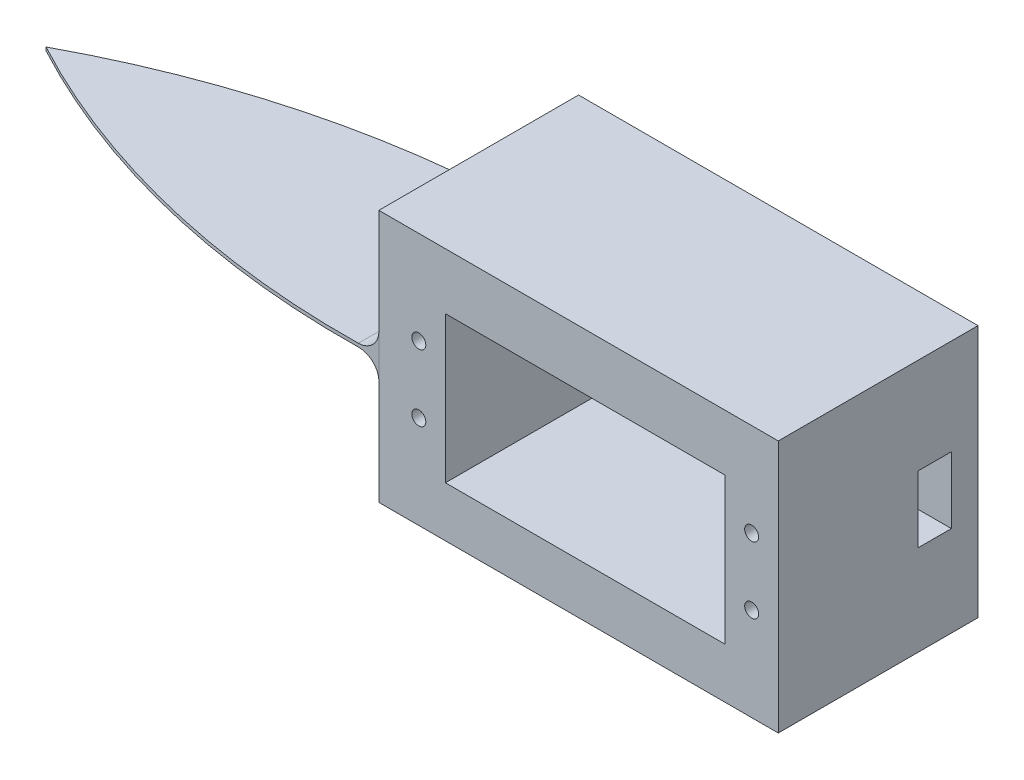
ISO-10303-21;
HEADER;
FILE_DESCRIPTION(('STEP AP214'),'2;1');
FILE_NAME('part.step','',(''),(''),'','','');
FILE_SCHEMA(('AUTOMOTIVE_DESIGN { 1 0 10303 214 1 1 1 1 }'));
ENDSEC;
DATA;
#1=APPLICATION_CONTEXT('core data for automotive mechanical design processes');
#2=APPLICATION_PROTOCOL_DEFINITION('international standard','automotive_design',2000,#1);
#3=PRODUCT_CONTEXT('',#1,'mechanical');
#4=PRODUCT('Part','Part','',(#3));
#5=PRODUCT_RELATED_PRODUCT_CATEGORY('part','',(#4));
#6=PRODUCT_DEFINITION_FORMATION('','',#4);
#7=PRODUCT_DEFINITION_CONTEXT('part definition',#1,'design');
#8=PRODUCT_DEFINITION('design','',#6,#7);
#9=PRODUCT_DEFINITION_SHAPE('','',#8);
#10=(LENGTH_UNIT() NAMED_UNIT(*) SI_UNIT(.MILLI.,.METRE.));
#11=(NAMED_UNIT(*) PLANE_ANGLE_UNIT() SI_UNIT($,.RADIAN.));
#12=(NAMED_UNIT(*) SI_UNIT($,.STERADIAN.) SOLID_ANGLE_UNIT());
#13=UNCERTAINTY_MEASURE_WITH_UNIT(LENGTH_MEASURE(1.E-05),#10,'distance_accuracy_value','');
#14=(GEOMETRIC_REPRESENTATION_CONTEXT(3) GLOBAL_UNCERTAINTY_ASSIGNED_CONTEXT((#13)) GLOBAL_UNIT_ASSIGNED_CONTEXT((#10,
#11,#12)) REPRESENTATION_CONTEXT('',''));
#15=CARTESIAN_POINT('',(0.,0.,0.));
#16=DIRECTION('',(0.,0.,1.));
#17=DIRECTION('',(1.,0.,0.));
#18=AXIS2_PLACEMENT_3D('',#15,#16,#17);
#19=CARTESIAN_POINT('',(20.7330474614907,6.88962887020134,-141.90367985973));
#20=DIRECTION('',(0.,0.,1.));
#21=DIRECTION('',(1.,0.,0.));
#22=AXIS2_PLACEMENT_3D('',#19,#20,#21);
#23=CYLINDRICAL_SURFACE('',#22,3.);
#24=DIRECTION('',(0.,0.,-1.));
#25=VECTOR('',#24,1.);
#26=CARTESIAN_POINT('',(20.7330474614907,3.88962887020134,-141.90367985973));
#27=LINE('',#26,#25);
#28=CARTESIAN_POINT('',(20.7330474614907,3.88962887020134,-14.9185791989542));
#29=VERTEX_POINT('',#28);
#30=CARTESIAN_POINT('',(20.7330474614909,3.88962887020134,-45.0814208010458));
#31=VERTEX_POINT('',#30);
#32=EDGE_CURVE('E169',#29,#31,#27,.T.);
#33=ORIENTED_EDGE('',*,*,#32,.F.);
#34=CARTESIAN_POINT('',(20.7330474614907,3.88962887020134,-14.9185791989542));
#35=CARTESIAN_POINT('',(20.8174437341798,3.8896207779731,-14.9198712607163));
#36=CARTESIAN_POINT('',(20.9018347910847,3.8931902039547,-14.9212490177742));
#37=CARTESIAN_POINT('',(21.0700100311668,3.90742077981252,-14.9241607449337));
#38=CARTESIAN_POINT('',(21.1537942446803,3.91808157268298,-14.9256947071682));
#39=CARTESIAN_POINT('',(21.3201001671258,3.94642002774165,-14.928902492407));
#40=CARTESIAN_POINT('',(21.402622849451,3.96409196345389,-14.9305762003928));
#41=CARTESIAN_POINT('',(21.5658636789148,4.00630879266722,-14.934042844555));
#42=CARTESIAN_POINT('',(21.6465818469567,4.03085360650939,-14.9358357793492));
#43=CARTESIAN_POINT('',(21.8852485180345,4.11459725947075,-14.9413599721025));
#44=CARTESIAN_POINT('',(22.0397798218832,4.18391741138222,-14.9452380002797));
#45=CARTESIAN_POINT('',(22.3349051623311,4.34747372945078,-14.9531402154769));
#46=CARTESIAN_POINT('',(22.4755007330017,4.4417071489114,-14.9571643863425));
#47=CARTESIAN_POINT('',(22.738943304813,4.65248080480235,-14.9650907790818));
#48=CARTESIAN_POINT('',(22.8617848246294,4.76902790457344,-14.9689929630035));
#49=CARTESIAN_POINT('',(23.0861512689847,5.02110716019958,-14.9763923034184));
#50=CARTESIAN_POINT('',(23.1876762375941,5.15663927680339,-14.9798894607489));
#51=CARTESIAN_POINT('',(23.3665112737786,5.44278925325287,-14.9862149189393));
#52=CARTESIAN_POINT('',(23.4438258897271,5.59340427246383,-14.9890433454084));
#53=CARTESIAN_POINT('',(23.5720841156532,5.90560073144451,-14.9938132460576));
#54=CARTESIAN_POINT('',(23.6230248134394,6.06718338002574,-14.9957546222874));
#55=CARTESIAN_POINT('',(23.6785129068275,6.31398151287236,-14.9978853675839));
#56=CARTESIAN_POINT('',(23.6935212551188,6.39697510902526,-14.9984653743577));
#57=CARTESIAN_POINT('',(23.716506783224,6.56395560635813,-14.9993559593844));
#58=CARTESIAN_POINT('',(23.7244838818621,6.6479425189946,-14.9996665345267));
#59=CARTESIAN_POINT('',(23.7333386232541,6.81635397515543,-15.0000112329252));
#60=CARTESIAN_POINT('',(23.734210422861,6.90077882174818,-15.0000451286499));
#61=CARTESIAN_POINT('',(23.7288459658642,7.06940607653108,-14.9998364810179));
#62=CARTESIAN_POINT('',(23.722609355818,7.15360847345197,-14.9995939239154));
#63=CARTESIAN_POINT('',(23.7128218606122,7.23739967164997,-14.999213443524));
#64=B_SPLINE_CURVE_WITH_KNOTS('',3,(#34,#35,#36,#37,#38,#39,#40,#41,#42,#43,#44,#45,#46,#47,#48,
#49,#50,#51,#52,#53,#54,#55,#56,#57,#58,#59,#60,#61,#62,#63),.UNSPECIFIED.,.F.,.F.,(4,2,2,2,2,2,
2,2,2,2,2,2,2,2,4),(0.,0.253135983667156,0.506259224492428,0.759176146619521,1.01209013747768,
1.51770579847131,2.02326573839101,2.52898143123072,3.0346960785262,3.54031566066427,
4.04599106109518,4.29877057181997,4.55155300084863,4.8045432882728,5.05754615536812),.UNSPECIFIED.);
#65=CARTESIAN_POINT('',(23.7330474614907,6.88962887020134,-15.));
#66=VERTEX_POINT('',#65);
#67=EDGE_CURVE('E53',#29,#66,#64,.T.);
#68=ORIENTED_EDGE('',*,*,#67,.T.);
#69=DIRECTION('',(0.,0.,-1.));
#70=VECTOR('',#69,1.);
#71=CARTESIAN_POINT('',(23.7330474614907,6.88962887020134,-141.90367985973));
#72=LINE('',#71,#70);
#73=CARTESIAN_POINT('',(23.7330474614908,6.88962887020134,-45.));
#74=VERTEX_POINT('',#73);
#75=EDGE_CURVE('E479',#74,#66,#72,.F.);
#76=ORIENTED_EDGE('',*,*,#75,.F.);
#77=CARTESIAN_POINT('',(20.7330474614909,3.88962887020134,-45.0814208010458));
#78=CARTESIAN_POINT('',(20.81744373418,3.8896207779731,-45.0801287392837));
#79=CARTESIAN_POINT('',(20.9018347910848,3.89319020395471,-45.0787509822259));
#80=CARTESIAN_POINT('',(21.070010031167,3.90742077981254,-45.0758392550662));
#81=CARTESIAN_POINT('',(21.1537942446804,3.918081572683,-45.0743052928317));
#82=CARTESIAN_POINT('',(21.320100167126,3.94642002774168,-45.0710975075929));
#83=CARTESIAN_POINT('',(21.4026228494511,3.96409196345393,-45.0694237996072));
#84=CARTESIAN_POINT('',(21.565863678915,4.00630879266728,-45.065957155445));
#85=CARTESIAN_POINT('',(21.6465818469568,4.03085360650945,-45.0641642206508));
#86=CARTESIAN_POINT('',(21.8852485180346,4.11459725947082,-45.0586400278975));
#87=CARTESIAN_POINT('',(22.0397798218833,4.1839174113823,-45.0547619997203));
#88=CARTESIAN_POINT('',(22.3349051623312,4.34747372945087,-45.0468597845231));
#89=CARTESIAN_POINT('',(22.4755007330019,4.44170714891151,-45.0428356136575));
#90=CARTESIAN_POINT('',(22.7389433048131,4.65248080480248,-45.0349092209182));
#91=CARTESIAN_POINT('',(22.8617848246296,4.76902790457358,-45.0310070369964));
#92=CARTESIAN_POINT('',(23.0861512689848,5.02110716019973,-45.0236076965816));
#93=CARTESIAN_POINT('',(23.1876762375942,5.15663927680354,-45.0201105392511));
#94=CARTESIAN_POINT('',(23.3665112737787,5.44278925325303,-45.0137850810607));
#95=CARTESIAN_POINT('',(23.4438258897272,5.59340427246399,-45.0109566545916));
#96=CARTESIAN_POINT('',(23.5720841156532,5.90560073144468,-45.0061867539424));
#97=CARTESIAN_POINT('',(23.6230248134395,6.06718338002591,-45.0042453777126));
#98=CARTESIAN_POINT('',(23.6785129068275,6.31398151287254,-45.0021146324161));
#99=CARTESIAN_POINT('',(23.6935212551188,6.39697510902544,-45.0015346256423));
#100=CARTESIAN_POINT('',(23.716506783224,6.56395560635831,-45.0006440406155));
#101=CARTESIAN_POINT('',(23.7244838818621,6.64794251899478,-45.0003334654732));
#102=CARTESIAN_POINT('',(23.7333386232542,6.81635397515561,-44.9999887670748));
#103=CARTESIAN_POINT('',(23.734210422861,6.90077882174836,-44.99995487135));
#104=CARTESIAN_POINT('',(23.7288459658642,7.06940607653126,-45.000163518982));
#105=CARTESIAN_POINT('',(23.722609355818,7.15360847345216,-45.0004060760845));
#106=CARTESIAN_POINT('',(23.7128218606122,7.23739967165015,-45.0007865564761));
#107=B_SPLINE_CURVE_WITH_KNOTS('',3,(#77,#78,#79,#80,#81,#82,#83,#84,#85,#86,#87,#88,#89,#90,
#91,#92,#93,#94,#95,#96,#97,#98,#99,#100,#101,#102,#103,#104,#105,#106),.UNSPECIFIED.,.F.,.F.,
(4,2,2,2,2,2,2,2,2,2,2,2,2,2,4),(0.,0.253135983667156,0.506259224492425,0.75917614661952,
1.01209013747768,1.51770579847131,2.02326573839102,2.52898143123073,3.0346960785262,
3.54031566066427,4.04599106109518,4.29877057181997,4.55155300084863,4.8045432882728,
5.05754615536812),.UNSPECIFIED.);
#108=EDGE_CURVE('E11',#74,#31,#107,.F.);
#109=ORIENTED_EDGE('',*,*,#108,.T.);
#110=EDGE_LOOP('',(#33,#68,#76,#109));
#111=FACE_BOUND('',#110,.T.);
#112=ADVANCED_FACE('F39',(#111),#23,.F.);
#113=CARTESIAN_POINT('',(20.7330474614907,0.389628870201336,-141.90367985973));
#114=DIRECTION('',(0.,0.,1.));
#115=DIRECTION('',(1.,0.,0.));
#116=AXIS2_PLACEMENT_3D('',#113,#114,#115);
#117=CYLINDRICAL_SURFACE('',#116,3.);
#118=DIRECTION('',(0.,0.,1.));
#119=VECTOR('',#118,1.);
#120=CARTESIAN_POINT('',(20.7330474614907,3.38962887020134,-141.90367985973));
#121=LINE('',#120,#119);
#122=CARTESIAN_POINT('',(20.7330474614907,3.38962887020134,-45.0814208010459));
#123=VERTEX_POINT('',#122);
#124=CARTESIAN_POINT('',(20.7330474614907,3.38962887020134,-14.9185791989542));
#125=VERTEX_POINT('',#124);
#126=EDGE_CURVE('E353',#123,#125,#121,.T.);
#127=ORIENTED_EDGE('',*,*,#126,.F.);
#128=CARTESIAN_POINT('',(20.7330474614907,3.38962887020134,-45.0814208010459));
#129=CARTESIAN_POINT('',(20.8174437341798,3.38963696242958,-45.0801287392837));
#130=CARTESIAN_POINT('',(20.9018347910846,3.38606753644798,-45.0787509822258));
#131=CARTESIAN_POINT('',(21.0700100311668,3.37183696059016,-45.0758392550663));
#132=CARTESIAN_POINT('',(21.1537942446802,3.3611761677197,-45.0743052928318));
#133=CARTESIAN_POINT('',(21.3201001671257,3.33283771266103,-45.071097507593));
#134=CARTESIAN_POINT('',(21.4026228494509,3.31516577694879,-45.0694237996072));
#135=CARTESIAN_POINT('',(21.5658636789148,3.27294894773546,-45.065957155445));
#136=CARTESIAN_POINT('',(21.6465818469566,3.24840413389329,-45.0641642206507));
#137=CARTESIAN_POINT('',(21.8852485180344,3.16466048093194,-45.0586400278975));
#138=CARTESIAN_POINT('',(22.0397798218831,3.09534032902047,-45.0547619997203));
#139=CARTESIAN_POINT('',(22.334905162331,2.93178401095192,-45.0468597845231));
#140=CARTESIAN_POINT('',(22.4755007330017,2.83755059149129,-45.0428356136575));
#141=CARTESIAN_POINT('',(22.7389433048129,2.62677693560035,-45.0349092209182));
#142=CARTESIAN_POINT('',(22.8617848246294,2.51022983582926,-45.0310070369965));
#143=CARTESIAN_POINT('',(23.0861512689847,2.25815058020312,-45.0236076965816));
#144=CARTESIAN_POINT('',(23.1876762375941,2.12261846359932,-45.0201105392511));
#145=CARTESIAN_POINT('',(23.3665112737786,1.83646848714984,-45.0137850810608));
#146=CARTESIAN_POINT('',(23.4438258897271,1.68585346793888,-45.0109566545916));
#147=CARTESIAN_POINT('',(23.5720841156531,1.37365700895821,-45.0061867539424));
#148=CARTESIAN_POINT('',(23.6230248134394,1.21207436037698,-45.0042453777126));
#149=CARTESIAN_POINT('',(23.6785129068275,0.965276227530356,-45.0021146324161));
#150=CARTESIAN_POINT('',(23.6935212551188,0.882282631377452,-45.0015346256423));
#151=CARTESIAN_POINT('',(23.716506783224,0.715302134044585,-45.0006440406156));
#152=CARTESIAN_POINT('',(23.7244838818621,0.631315221408116,-45.0003334654732));
#153=CARTESIAN_POINT('',(23.7333386232541,0.462903765247286,-44.9999887670748));
#154=CARTESIAN_POINT('',(23.734210422861,0.378478918654535,-44.9999548713501));
#155=CARTESIAN_POINT('',(23.7288459658642,0.209851663871638,-45.0001635189821));
#156=CARTESIAN_POINT('',(23.722609355818,0.125649266950742,-45.0004060760846));
#157=CARTESIAN_POINT('',(23.7128218606122,0.0418580687527476,-45.000786556476));
#158=B_SPLINE_CURVE_WITH_KNOTS('',3,(#128,#129,#130,#131,#132,#133,#134,#135,#136,#137,#138,
#139,#140,#141,#142,#143,#144,#145,#146,#147,#148,#149,#150,#151,#152,#153,#154,#155,#156,#157),
.UNSPECIFIED.,.F.,.F.,(4,2,2,2,2,2,2,2,2,2,2,2,2,2,4),(0.,0.253135983667159,0.506259224492432,
0.759176146619528,1.01209013747768,1.51770579847132,2.02326573839102,2.52898143123073,
3.03469607852621,3.54031566066428,4.04599106109518,4.29877057181998,4.55155300084864,
4.80454328827281,5.05754615536813),.UNSPECIFIED.);
#159=CARTESIAN_POINT('',(23.7330474614907,0.389628870201338,-45.));
#160=VERTEX_POINT('',#159);
#161=EDGE_CURVE('E361',#123,#160,#158,.T.);
#162=ORIENTED_EDGE('',*,*,#161,.T.);
#163=DIRECTION('',(0.,0.,1.));
#164=VECTOR('',#163,1.);
#165=CARTESIAN_POINT('',(23.7330474614907,0.389628870201337,0.));
#166=LINE('',#165,#164);
#167=CARTESIAN_POINT('',(23.7330474614907,0.389628870201338,-15.));
#168=VERTEX_POINT('',#167);
#169=EDGE_CURVE('E357',#168,#160,#166,.F.);
#170=ORIENTED_EDGE('',*,*,#169,.F.);
#171=CARTESIAN_POINT('',(20.7330474614907,3.38962887020134,-14.9185791989542));
#172=CARTESIAN_POINT('',(20.8174437341798,3.38963696242958,-14.9198712607163));
#173=CARTESIAN_POINT('',(20.9018347910847,3.38606753644798,-14.9212490177742));
#174=CARTESIAN_POINT('',(21.0700100311668,3.37183696059015,-14.9241607449337));
#175=CARTESIAN_POINT('',(21.1537942446803,3.3611761677197,-14.9256947071682));
#176=CARTESIAN_POINT('',(21.3201001671258,3.33283771266103,-14.928902492407));
#177=CARTESIAN_POINT('',(21.402622849451,3.31516577694878,-14.9305762003928));
#178=CARTESIAN_POINT('',(21.5658636789148,3.27294894773545,-14.934042844555));
#179=CARTESIAN_POINT('',(21.6465818469567,3.24840413389328,-14.9358357793492));
#180=CARTESIAN_POINT('',(21.8852485180345,3.16466048093192,-14.9413599721025));
#181=CARTESIAN_POINT('',(22.0397798218832,3.09534032902045,-14.9452380002797));
#182=CARTESIAN_POINT('',(22.3349051623311,2.9317840109519,-14.9531402154769));
#183=CARTESIAN_POINT('',(22.4755007330017,2.83755059149127,-14.9571643863425));
#184=CARTESIAN_POINT('',(22.738943304813,2.62677693560032,-14.9650907790818));
#185=CARTESIAN_POINT('',(22.8617848246294,2.51022983582923,-14.9689929630035));
#186=CARTESIAN_POINT('',(23.0861512689847,2.25815058020309,-14.9763923034184));
#187=CARTESIAN_POINT('',(23.1876762375941,2.12261846359928,-14.9798894607489));
#188=CARTESIAN_POINT('',(23.3665112737786,1.8364684871498,-14.9862149189393));
#189=CARTESIAN_POINT('',(23.4438258897271,1.68585346793884,-14.9890433454084));
#190=CARTESIAN_POINT('',(23.5720841156532,1.37365700895816,-14.9938132460576));
#191=CARTESIAN_POINT('',(23.6230248134394,1.21207436037693,-14.9957546222874));
#192=CARTESIAN_POINT('',(23.6785129068275,0.965276227530312,-14.9978853675839));
#193=CARTESIAN_POINT('',(23.6935212551188,0.882282631377409,-14.9984653743577));
#194=CARTESIAN_POINT('',(23.716506783224,0.715302134044542,-14.9993559593844));
#195=CARTESIAN_POINT('',(23.7244838818621,0.631315221408073,-14.9996665345267));
#196=CARTESIAN_POINT('',(23.7333386232542,0.462903765247244,-15.0000112329252));
#197=CARTESIAN_POINT('',(23.734210422861,0.378478918654492,-15.0000451286499));
#198=CARTESIAN_POINT('',(23.7288459658642,0.209851663871596,-14.9998364810179));
#199=CARTESIAN_POINT('',(23.722609355818,0.125649266950701,-14.9995939239154));
#200=CARTESIAN_POINT('',(23.7128218606122,0.0418580687527065,-14.999213443524));
#201=B_SPLINE_CURVE_WITH_KNOTS('',3,(#171,#172,#173,#174,#175,#176,#177,#178,#179,#180,#181,
#182,#183,#184,#185,#186,#187,#188,#189,#190,#191,#192,#193,#194,#195,#196,#197,#198,#199,#200),
.UNSPECIFIED.,.F.,.F.,(4,2,2,2,2,2,2,2,2,2,2,2,2,2,4),(0.,0.253135983667156,0.506259224492428,
0.759176146619529,1.01209013747768,1.51770579847131,2.02326573839102,2.52898143123072,
3.0346960785262,3.54031566066428,4.04599106109518,4.29877057181997,4.55155300084864,
4.80454328827281,5.05754615536812),.UNSPECIFIED.);
#202=EDGE_CURVE('E369',#168,#125,#201,.F.);
#203=ORIENTED_EDGE('',*,*,#202,.T.);
#204=EDGE_LOOP('',(#127,#162,#170,#203));
#205=FACE_BOUND('',#204,.T.);
#206=ADVANCED_FACE('F378',(#205),#117,.F.);
#207=CARTESIAN_POINT('',(23.7330474614907,0.,0.));
#208=DIRECTION('',(1.,0.,0.));
#209=DIRECTION('',(0.,1.,0.));
#210=AXIS2_PLACEMENT_3D('',#207,#208,#209);
#211=PLANE('',#210);
#212=DIRECTION('',(0.,1.,0.));
#213=VECTOR('',#212,1.);
#214=CARTESIAN_POINT('',(23.7330474614907,22.6396288702013,-15.));
#215=LINE('',#214,#213);
#216=CARTESIAN_POINT('',(23.7330474614907,-15.3603711297987,-15.));
#217=VERTEX_POINT('',#216);
#218=EDGE_CURVE('E314',#217,#168,#215,.T.);
#219=ORIENTED_EDGE('',*,*,#218,.T.);
#220=ORIENTED_EDGE('',*,*,#169,.T.);
#221=DIRECTION('',(0.,1.,0.));
#222=VECTOR('',#221,1.);
#223=CARTESIAN_POINT('',(23.7330474614907,11.6396288702014,-45.));
#224=LINE('',#223,#222);
#225=CARTESIAN_POINT('',(23.7330474614907,-15.3603711297987,-45.));
#226=VERTEX_POINT('',#225);
#227=EDGE_CURVE('E341',#226,#160,#224,.T.);
#228=ORIENTED_EDGE('',*,*,#227,.F.);
#229=DIRECTION('',(0.,0.,-1.));
#230=VECTOR('',#229,1.);
#231=CARTESIAN_POINT('',(23.7330474614907,-15.3603711297987,-15.));
#232=LINE('',#231,#230);
#233=EDGE_CURVE('E327',#217,#226,#232,.T.);
#234=ORIENTED_EDGE('',*,*,#233,.F.);
#235=EDGE_LOOP('',(#219,#220,#228,#234));
#236=FACE_BOUND('',#235,.T.);
#237=ADVANCED_FACE('F382',(#236),#211,.F.);
#238=CARTESIAN_POINT('',(27.7330474614907,11.6396288702014,-45.));
#239=DIRECTION('',(0.,0.,1.));
#240=DIRECTION('',(1.,0.,0.));
#241=AXIS2_PLACEMENT_3D('',#238,#239,#240);
#242=PLANE('',#241);
#243=ORIENTED_EDGE('',*,*,#227,.T.);
#244=DIRECTION('',(0.,1.,0.));
#245=VECTOR('',#244,1.);
#246=CARTESIAN_POINT('',(23.7330474614908,3.38962887020134,-45.));
#247=LINE('',#246,#245);
#248=EDGE_CURVE('E68',#160,#74,#247,.T.);
#249=ORIENTED_EDGE('',*,*,#248,.T.);
#250=DIRECTION('',(0.,1.,0.));
#251=VECTOR('',#250,1.);
#252=CARTESIAN_POINT('',(23.7330474614908,3.88962887020134,-45.));
#253=LINE('',#252,#251);
#254=CARTESIAN_POINT('',(23.7330474614908,22.6396288702013,-45.));
#255=VERTEX_POINT('',#254);
#256=EDGE_CURVE('E490',#74,#255,#253,.T.);
#257=ORIENTED_EDGE('',*,*,#256,.T.);
#258=DIRECTION('',(1.,0.,0.));
#259=VECTOR('',#258,1.);
#260=CARTESIAN_POINT('',(23.7330474614907,22.6396288702013,-45.));
#261=LINE('',#260,#259);
#262=CARTESIAN_POINT('',(83.7330474614907,22.6396288702013,-45.));
#263=VERTEX_POINT('',#262);
#264=EDGE_CURVE('E301',#255,#263,#261,.T.);
#265=ORIENTED_EDGE('',*,*,#264,.T.);
#266=DIRECTION('',(0.,-1.,0.));
#267=VECTOR('',#266,1.);
#268=CARTESIAN_POINT('',(83.7330474614907,-15.3603711297987,-45.));
#269=LINE('',#268,#267);
#270=CARTESIAN_POINT('',(83.7330474614907,-15.3603711297987,-45.));
#271=VERTEX_POINT('',#270);
#272=EDGE_CURVE('E331',#263,#271,#269,.T.);
#273=ORIENTED_EDGE('',*,*,#272,.T.);
#274=DIRECTION('',(-1.,0.,0.));
#275=VECTOR('',#274,1.);
#276=CARTESIAN_POINT('',(30.9461924588656,-15.3603711297987,-45.));
#277=LINE('',#276,#275);
#278=EDGE_CURVE('E315',#271,#226,#277,.T.);
#279=ORIENTED_EDGE('',*,*,#278,.T.);
#280=EDGE_LOOP('',(#243,#249,#257,#265,#273,#279));
#281=FACE_BOUND('',#280,.T.);
#282=ADVANCED_FACE('F384',(#281),#242,.F.);
#283=CARTESIAN_POINT('',(0.,0.,-15.));
#284=DIRECTION('',(0.,0.,1.));
#285=DIRECTION('',(1.,0.,0.));
#286=AXIS2_PLACEMENT_3D('',#283,#284,#285);
#287=PLANE('',#286);
#288=ORIENTED_EDGE('',*,*,#218,.F.);
#289=DIRECTION('',(-1.,0.,0.));
#290=VECTOR('',#289,1.);
#291=CARTESIAN_POINT('',(23.7330474614907,-15.3603711297987,-15.));
#292=LINE('',#291,#290);
#293=CARTESIAN_POINT('',(83.7330474614907,-15.3603711297987,-15.));
#294=VERTEX_POINT('',#293);
#295=EDGE_CURVE('E310',#294,#217,#292,.T.);
#296=ORIENTED_EDGE('',*,*,#295,.F.);
#297=DIRECTION('',(0.,-1.,0.));
#298=VECTOR('',#297,1.);
#299=CARTESIAN_POINT('',(83.7330474614907,-15.3603711297987,-15.));
#300=LINE('',#299,#298);
#301=CARTESIAN_POINT('',(83.7330474614907,22.6396288702013,-15.));
#302=VERTEX_POINT('',#301);
#303=EDGE_CURVE('E323',#302,#294,#300,.T.);
#304=ORIENTED_EDGE('',*,*,#303,.F.);
#305=DIRECTION('',(1.,0.,0.));
#306=VECTOR('',#305,1.);
#307=CARTESIAN_POINT('',(23.7330474614907,22.6396288702013,-15.));
#308=LINE('',#307,#306);
#309=CARTESIAN_POINT('',(23.7330474614907,22.6396288702013,-15.));
#310=VERTEX_POINT('',#309);
#311=EDGE_CURVE('E319',#310,#302,#308,.T.);
#312=ORIENTED_EDGE('',*,*,#311,.F.);
#313=DIRECTION('',(0.,1.,0.));
#314=VECTOR('',#313,1.);
#315=CARTESIAN_POINT('',(23.7330474614907,3.88962887020133,-15.));
#316=LINE('',#315,#314);
#317=EDGE_CURVE('E173',#66,#310,#316,.T.);
#318=ORIENTED_EDGE('',*,*,#317,.F.);
#319=DIRECTION('',(0.,1.,0.));
#320=VECTOR('',#319,1.);
#321=CARTESIAN_POINT('',(23.7330474614907,3.38962887020133,-15.));
#322=LINE('',#321,#320);
#323=EDGE_CURVE('E60',#168,#66,#322,.T.);
#324=ORIENTED_EDGE('',*,*,#323,.F.);
#325=EDGE_LOOP('',(#288,#296,#304,#312,#318,#324));
#326=FACE_BOUND('',#325,.T.);
#327=CARTESIAN_POINT('',(29.7330474614907,-1.36037112979867,-15.));
#328=DIRECTION('',(0.,0.,1.));
#329=DIRECTION('',(1.,0.,0.));
#330=AXIS2_PLACEMENT_3D('',#327,#328,#329);
#331=CIRCLE('',#330,1.05);
#332=CARTESIAN_POINT('',(30.7830474614907,-1.36037112979867,-15.));
#333=VERTEX_POINT('',#332);
#334=EDGE_CURVE('E263',#333,#333,#331,.T.);
#335=ORIENTED_EDGE('',*,*,#334,.F.);
#336=EDGE_LOOP('',(#335));
#337=FACE_BOUND('',#336,.T.);
#338=CARTESIAN_POINT('',(79.7330474614908,8.63962887020133,-15.));
#339=DIRECTION('',(0.,0.,1.));
#340=DIRECTION('',(1.,0.,0.));
#341=AXIS2_PLACEMENT_3D('',#338,#339,#340);
#342=CIRCLE('',#341,1.04999999999999);
#343=CARTESIAN_POINT('',(80.7830474614907,8.63962887020133,-15.));
#344=VERTEX_POINT('',#343);
#345=EDGE_CURVE('E254',#344,#344,#342,.T.);
#346=ORIENTED_EDGE('',*,*,#345,.F.);
#347=EDGE_LOOP('',(#346));
#348=FACE_BOUND('',#347,.T.);
#349=CARTESIAN_POINT('',(79.7330474614908,-1.36037112979867,-15.));
#350=DIRECTION('',(0.,0.,1.));
#351=DIRECTION('',(1.,0.,0.));
#352=AXIS2_PLACEMENT_3D('',#349,#350,#351);
#353=CIRCLE('',#352,1.04999999999999);
#354=CARTESIAN_POINT('',(80.7830474614907,-1.36037112979867,-15.));
#355=VERTEX_POINT('',#354);
#356=EDGE_CURVE('E246',#355,#355,#353,.T.);
#357=ORIENTED_EDGE('',*,*,#356,.F.);
#358=EDGE_LOOP('',(#357));
#359=FACE_BOUND('',#358,.T.);
#360=CARTESIAN_POINT('',(29.7330474614907,8.63962887020133,-15.));
#361=DIRECTION('',(0.,0.,1.));
#362=DIRECTION('',(1.,0.,0.));
#363=AXIS2_PLACEMENT_3D('',#360,#361,#362);
#364=CIRCLE('',#363,1.05);
#365=CARTESIAN_POINT('',(30.7830474614907,8.63962887020133,-15.));
#366=VERTEX_POINT('',#365);
#367=EDGE_CURVE('E262',#366,#366,#364,.T.);
#368=ORIENTED_EDGE('',*,*,#367,.F.);
#369=EDGE_LOOP('',(#368));
#370=FACE_BOUND('',#369,.T.);
#371=DIRECTION('',(0.,-1.,0.));
#372=VECTOR('',#371,1.);
#373=CARTESIAN_POINT('',(33.7330474614907,3.1939047432246,-15.));
#374=LINE('',#373,#372);
#375=CARTESIAN_POINT('',(33.7330474614907,14.1939047432246,-15.));
#376=VERTEX_POINT('',#375);
#377=CARTESIAN_POINT('',(33.7330474614907,-7.8060952567754,-15.));
#378=VERTEX_POINT('',#377);
#379=EDGE_CURVE('E293',#376,#378,#374,.T.);
#380=ORIENTED_EDGE('',*,*,#379,.F.);
#381=DIRECTION('',(-1.,0.,0.));
#382=VECTOR('',#381,1.);
#383=CARTESIAN_POINT('',(33.7330474614907,14.1939047432246,-15.));
#384=LINE('',#383,#382);
#385=CARTESIAN_POINT('',(75.7330474614907,14.1939047432246,-15.));
#386=VERTEX_POINT('',#385);
#387=EDGE_CURVE('E289',#386,#376,#384,.T.);
#388=ORIENTED_EDGE('',*,*,#387,.F.);
#389=DIRECTION('',(0.,1.,0.));
#390=VECTOR('',#389,1.);
#391=CARTESIAN_POINT('',(75.7330474614907,-7.8060952567754,-15.));
#392=LINE('',#391,#390);
#393=CARTESIAN_POINT('',(75.7330474614907,-7.8060952567754,-15.));
#394=VERTEX_POINT('',#393);
#395=EDGE_CURVE('E285',#394,#386,#392,.T.);
#396=ORIENTED_EDGE('',*,*,#395,.F.);
#397=DIRECTION('',(1.,0.,0.));
#398=VECTOR('',#397,1.);
#399=CARTESIAN_POINT('',(33.7330474614907,-7.8060952567754,-15.));
#400=LINE('',#399,#398);
#401=EDGE_CURVE('E278',#378,#394,#400,.T.);
#402=ORIENTED_EDGE('',*,*,#401,.F.);
#403=EDGE_LOOP('',(#380,#388,#396,#402));
#404=FACE_BOUND('',#403,.T.);
#405=ADVANCED_FACE('F388',(#326,#337,#348,#359,#370,#404),#287,.T.);
#406=CARTESIAN_POINT('',(30.9461924588656,-15.3603711297987,-15.));
#407=DIRECTION('',(0.,-1.,0.));
#408=DIRECTION('',(0.,0.,-1.));
#409=AXIS2_PLACEMENT_3D('',#406,#407,#408);
#410=PLANE('',#409);
#411=ORIENTED_EDGE('',*,*,#233,.T.);
#412=ORIENTED_EDGE('',*,*,#278,.F.);
#413=DIRECTION('',(0.,0.,-1.));
#414=VECTOR('',#413,1.);
#415=CARTESIAN_POINT('',(83.7330474614907,-15.3603711297987,-15.));
#416=LINE('',#415,#414);
#417=EDGE_CURVE('E338',#294,#271,#416,.T.);
#418=ORIENTED_EDGE('',*,*,#417,.F.);
#419=ORIENTED_EDGE('',*,*,#295,.T.);
#420=EDGE_LOOP('',(#411,#412,#418,#419));
#421=FACE_BOUND('',#420,.T.);
#422=ADVANCED_FACE('F400',(#421),#410,.T.);
#423=CARTESIAN_POINT('',(83.7330474614907,-15.3603711297987,-15.));
#424=DIRECTION('',(1.,0.,0.));
#425=DIRECTION('',(0.,0.,-1.));
#426=AXIS2_PLACEMENT_3D('',#423,#424,#425);
#427=PLANE('',#426);
#428=DIRECTION('',(0.,0.,1.));
#429=VECTOR('',#428,1.);
#430=CARTESIAN_POINT('',(83.7330474614907,8.23858499545058,-42.));
#431=LINE('',#430,#429);
#432=CARTESIAN_POINT('',(83.7330474614907,8.23858499545058,-41.));
#433=VERTEX_POINT('',#432);
#434=CARTESIAN_POINT('',(83.7330474614907,8.23858499545058,-36.));
#435=VERTEX_POINT('',#434);
#436=EDGE_CURVE('E220',#433,#435,#431,.T.);
#437=ORIENTED_EDGE('',*,*,#436,.F.);
#438=DIRECTION('',(0.,-1.,0.));
#439=VECTOR('',#438,1.);
#440=CARTESIAN_POINT('',(83.7330474614907,-15.3603711297987,-41.));
#441=LINE('',#440,#439);
#442=CARTESIAN_POINT('',(83.7330474614907,-1.76141500454942,-41.));
#443=VERTEX_POINT('',#442);
#444=EDGE_CURVE('E187',#433,#443,#441,.T.);
#445=ORIENTED_EDGE('',*,*,#444,.T.);
#446=DIRECTION('',(0.,0.,-1.));
#447=VECTOR('',#446,1.);
#448=CARTESIAN_POINT('',(83.7330474614907,-1.76141500454942,-42.));
#449=LINE('',#448,#447);
#450=CARTESIAN_POINT('',(83.7330474614907,-1.76141500454942,-36.));
#451=VERTEX_POINT('',#450);
#452=EDGE_CURVE('E225',#451,#443,#449,.T.);
#453=ORIENTED_EDGE('',*,*,#452,.F.);
#454=DIRECTION('',(0.,-1.,0.));
#455=VECTOR('',#454,1.);
#456=CARTESIAN_POINT('',(83.7330474614907,-1.76141500454942,-36.));
#457=LINE('',#456,#455);
#458=EDGE_CURVE('E236',#435,#451,#457,.T.);
#459=ORIENTED_EDGE('',*,*,#458,.F.);
#460=EDGE_LOOP('',(#437,#445,#453,#459));
#461=FACE_BOUND('',#460,.T.);
#462=ORIENTED_EDGE('',*,*,#272,.F.);
#463=DIRECTION('',(0.,0.,-1.));
#464=VECTOR('',#463,1.);
#465=CARTESIAN_POINT('',(83.7330474614907,22.6396288702013,-15.));
#466=LINE('',#465,#464);
#467=EDGE_CURVE('E342',#302,#263,#466,.T.);
#468=ORIENTED_EDGE('',*,*,#467,.F.);
#469=ORIENTED_EDGE('',*,*,#303,.T.);
#470=ORIENTED_EDGE('',*,*,#417,.T.);
#471=EDGE_LOOP('',(#462,#468,#469,#470));
#472=FACE_BOUND('',#471,.T.);
#473=ADVANCED_FACE('F396',(#461,#472),#427,.T.);
#474=CARTESIAN_POINT('',(23.7330474614907,22.6396288702013,-15.));
#475=DIRECTION('',(0.,1.,0.));
#476=DIRECTION('',(-1.,0.,0.));
#477=AXIS2_PLACEMENT_3D('',#474,#475,#476);
#478=PLANE('',#477);
#479=DIRECTION('',(0.,0.,-1.));
#480=VECTOR('',#479,1.);
#481=CARTESIAN_POINT('',(23.7330474614907,22.6396288702013,-45.));
#482=LINE('',#481,#480);
#483=EDGE_CURVE('E181',#310,#255,#482,.T.);
#484=ORIENTED_EDGE('',*,*,#483,.F.);
#485=ORIENTED_EDGE('',*,*,#311,.T.);
#486=ORIENTED_EDGE('',*,*,#467,.T.);
#487=ORIENTED_EDGE('',*,*,#264,.F.);
#488=EDGE_LOOP('',(#484,#485,#486,#487));
#489=FACE_BOUND('',#488,.T.);
#490=ADVANCED_FACE('F392',(#489),#478,.T.);
#491=CARTESIAN_POINT('',(33.7330474614907,3.1939047432246,-43.));
#492=DIRECTION('',(-1.,0.,0.));
#493=DIRECTION('',(0.,0.,1.));
#494=AXIS2_PLACEMENT_3D('',#491,#492,#493);
#495=PLANE('',#494);
#496=DIRECTION('',(0.,0.,1.));
#497=VECTOR('',#496,1.);
#498=CARTESIAN_POINT('',(33.7330474614907,-7.8060952567754,-43.));
#499=LINE('',#498,#497);
#500=CARTESIAN_POINT('',(33.7330474614907,-7.8060952567754,-41.));
#501=VERTEX_POINT('',#500);
#502=EDGE_CURVE('E297',#501,#378,#499,.T.);
#503=ORIENTED_EDGE('',*,*,#502,.F.);
#504=DIRECTION('',(0.,1.,0.));
#505=VECTOR('',#504,1.);
#506=CARTESIAN_POINT('',(33.7330474614907,3.1939047432246,-41.));
#507=LINE('',#506,#505);
#508=CARTESIAN_POINT('',(33.7330474614907,14.1939047432246,-41.));
#509=VERTEX_POINT('',#508);
#510=EDGE_CURVE('E208',#501,#509,#507,.T.);
#511=ORIENTED_EDGE('',*,*,#510,.T.);
#512=DIRECTION('',(0.,0.,1.));
#513=VECTOR('',#512,1.);
#514=CARTESIAN_POINT('',(33.7330474614907,14.1939047432246,-43.));
#515=LINE('',#514,#513);
#516=EDGE_CURVE('E298',#509,#376,#515,.T.);
#517=ORIENTED_EDGE('',*,*,#516,.T.);
#518=ORIENTED_EDGE('',*,*,#379,.T.);
#519=EDGE_LOOP('',(#503,#511,#517,#518));
#520=FACE_BOUND('',#519,.T.);
#521=ADVANCED_FACE('F395',(#520),#495,.F.);
#522=CARTESIAN_POINT('',(33.7330474614907,14.1939047432246,-43.));
#523=DIRECTION('',(0.,1.,0.));
#524=DIRECTION('',(0.,0.,1.));
#525=AXIS2_PLACEMENT_3D('',#522,#523,#524);
#526=PLANE('',#525);
#527=ORIENTED_EDGE('',*,*,#516,.F.);
#528=DIRECTION('',(1.,0.,0.));
#529=VECTOR('',#528,1.);
#530=CARTESIAN_POINT('',(33.7330474614907,14.1939047432246,-41.));
#531=LINE('',#530,#529);
#532=CARTESIAN_POINT('',(75.7330474614907,14.1939047432246,-41.));
#533=VERTEX_POINT('',#532);
#534=EDGE_CURVE('E203',#509,#533,#531,.T.);
#535=ORIENTED_EDGE('',*,*,#534,.T.);
#536=DIRECTION('',(0.,0.,1.));
#537=VECTOR('',#536,1.);
#538=CARTESIAN_POINT('',(75.7330474614907,14.1939047432246,-43.));
#539=LINE('',#538,#537);
#540=EDGE_CURVE('E302',#533,#386,#539,.T.);
#541=ORIENTED_EDGE('',*,*,#540,.T.);
#542=ORIENTED_EDGE('',*,*,#387,.T.);
#543=EDGE_LOOP('',(#527,#535,#541,#542));
#544=FACE_BOUND('',#543,.T.);
#545=ADVANCED_FACE('F416',(#544),#526,.F.);
#546=CARTESIAN_POINT('',(75.7330474614907,-7.8060952567754,-43.));
#547=DIRECTION('',(1.,0.,0.));
#548=DIRECTION('',(0.,0.,-1.));
#549=AXIS2_PLACEMENT_3D('',#546,#547,#548);
#550=PLANE('',#549);
#551=ORIENTED_EDGE('',*,*,#540,.F.);
#552=DIRECTION('',(0.,-1.,0.));
#553=VECTOR('',#552,1.);
#554=CARTESIAN_POINT('',(75.7330474614907,-7.8060952567754,-41.));
#555=LINE('',#554,#553);
#556=CARTESIAN_POINT('',(75.7330474614907,8.23858499545058,-41.));
#557=VERTEX_POINT('',#556);
#558=EDGE_CURVE('E192',#533,#557,#555,.T.);
#559=ORIENTED_EDGE('',*,*,#558,.T.);
#560=DIRECTION('',(0.,0.,1.));
#561=VECTOR('',#560,1.);
#562=CARTESIAN_POINT('',(75.7330474614907,8.23858499545058,-42.));
#563=LINE('',#562,#561);
#564=CARTESIAN_POINT('',(75.7330474614907,8.23858499545058,-36.));
#565=VERTEX_POINT('',#564);
#566=EDGE_CURVE('E221',#557,#565,#563,.T.);
#567=ORIENTED_EDGE('',*,*,#566,.T.);
#568=DIRECTION('',(0.,-1.,0.));
#569=VECTOR('',#568,1.);
#570=CARTESIAN_POINT('',(75.7330474614907,-1.76141500454942,-36.));
#571=LINE('',#570,#569);
#572=CARTESIAN_POINT('',(75.7330474614907,-1.76141500454942,-36.));
#573=VERTEX_POINT('',#572);
#574=EDGE_CURVE('E224',#565,#573,#571,.T.);
#575=ORIENTED_EDGE('',*,*,#574,.T.);
#576=DIRECTION('',(0.,0.,-1.));
#577=VECTOR('',#576,1.);
#578=CARTESIAN_POINT('',(75.7330474614907,-1.76141500454942,-42.));
#579=LINE('',#578,#577);
#580=CARTESIAN_POINT('',(75.7330474614907,-1.76141500454942,-41.));
#581=VERTEX_POINT('',#580);
#582=EDGE_CURVE('E229',#573,#581,#579,.T.);
#583=ORIENTED_EDGE('',*,*,#582,.T.);
#584=CARTESIAN_POINT('',(75.7330474614907,-7.8060952567754,-41.));
#585=VERTEX_POINT('',#584);
#586=EDGE_CURVE('E204',#581,#585,#555,.T.);
#587=ORIENTED_EDGE('',*,*,#586,.T.);
#588=DIRECTION('',(0.,0.,1.));
#589=VECTOR('',#588,1.);
#590=CARTESIAN_POINT('',(75.7330474614907,-7.8060952567754,-43.));
#591=LINE('',#590,#589);
#592=EDGE_CURVE('E305',#585,#394,#591,.T.);
#593=ORIENTED_EDGE('',*,*,#592,.T.);
#594=ORIENTED_EDGE('',*,*,#395,.T.);
#595=EDGE_LOOP('',(#551,#559,#567,#575,#583,#587,#593,#594));
#596=FACE_BOUND('',#595,.T.);
#597=ADVANCED_FACE('F412',(#596),#550,.F.);
#598=CARTESIAN_POINT('',(33.7330474614907,-7.8060952567754,-43.));
#599=DIRECTION('',(0.,-1.,0.));
#600=DIRECTION('',(0.,0.,-1.));
#601=AXIS2_PLACEMENT_3D('',#598,#599,#600);
#602=PLANE('',#601);
#603=ORIENTED_EDGE('',*,*,#592,.F.);
#604=DIRECTION('',(-1.,0.,0.));
#605=VECTOR('',#604,1.);
#606=CARTESIAN_POINT('',(33.7330474614907,-7.8060952567754,-41.));
#607=LINE('',#606,#605);
#608=EDGE_CURVE('E212',#585,#501,#607,.T.);
#609=ORIENTED_EDGE('',*,*,#608,.T.);
#610=ORIENTED_EDGE('',*,*,#502,.T.);
#611=ORIENTED_EDGE('',*,*,#401,.T.);
#612=EDGE_LOOP('',(#603,#609,#610,#611));
#613=FACE_BOUND('',#612,.T.);
#614=ADVANCED_FACE('F408',(#613),#602,.F.);
#615=CARTESIAN_POINT('',(29.7330474614907,8.63962887020133,-35.));
#616=DIRECTION('',(0.,0.,1.));
#617=DIRECTION('',(1.,0.,0.));
#618=AXIS2_PLACEMENT_3D('',#615,#616,#617);
#619=CYLINDRICAL_SURFACE('',#618,1.05);
#620=CARTESIAN_POINT('',(29.7330474614907,8.63962887020133,-35.));
#621=DIRECTION('',(0.,0.,1.));
#622=DIRECTION('',(1.,0.,0.));
#623=AXIS2_PLACEMENT_3D('',#620,#621,#622);
#624=CIRCLE('',#623,1.05);
#625=CARTESIAN_POINT('',(30.7830474614907,8.63962887020133,-35.));
#626=VERTEX_POINT('',#625);
#627=EDGE_CURVE('E274',#626,#626,#624,.T.);
#628=ORIENTED_EDGE('',*,*,#627,.F.);
#629=EDGE_LOOP('',(#628));
#630=FACE_BOUND('',#629,.T.);
#631=ORIENTED_EDGE('',*,*,#367,.T.);
#632=EDGE_LOOP('',(#631));
#633=FACE_BOUND('',#632,.T.);
#634=ADVANCED_FACE('F411',(#630,#633),#619,.F.);
#635=CARTESIAN_POINT('',(29.7330474614907,8.63962887020133,-35.));
#636=DIRECTION('',(0.,0.,1.));
#637=DIRECTION('',(1.,0.,0.));
#638=AXIS2_PLACEMENT_3D('',#635,#636,#637);
#639=PLANE('',#638);
#640=ORIENTED_EDGE('',*,*,#627,.T.);
#641=EDGE_LOOP('',(#640));
#642=FACE_BOUND('',#641,.T.);
#643=ADVANCED_FACE('F426',(#642),#639,.T.);
#644=CARTESIAN_POINT('',(79.7330474614908,-1.36037112979867,-35.));
#645=DIRECTION('',(0.,0.,1.));
#646=DIRECTION('',(1.,0.,0.));
#647=AXIS2_PLACEMENT_3D('',#644,#645,#646);
#648=CYLINDRICAL_SURFACE('',#647,1.04999999999999);
#649=CARTESIAN_POINT('',(79.7330474614908,-1.36037112979867,-35.));
#650=DIRECTION('',(0.,0.,1.));
#651=DIRECTION('',(1.,0.,0.));
#652=AXIS2_PLACEMENT_3D('',#649,#650,#651);
#653=CIRCLE('',#652,1.04999999999999);
#654=CARTESIAN_POINT('',(80.7830474614907,-1.36037112979867,-35.));
#655=VERTEX_POINT('',#654);
#656=EDGE_CURVE('E250',#655,#655,#653,.T.);
#657=ORIENTED_EDGE('',*,*,#656,.F.);
#658=EDGE_LOOP('',(#657));
#659=FACE_BOUND('',#658,.T.);
#660=ORIENTED_EDGE('',*,*,#356,.T.);
#661=EDGE_LOOP('',(#660));
#662=FACE_BOUND('',#661,.T.);
#663=ADVANCED_FACE('F430',(#659,#662),#648,.F.);
#664=CARTESIAN_POINT('',(79.7330474614908,-1.36037112979867,-35.));
#665=DIRECTION('',(0.,0.,1.));
#666=DIRECTION('',(1.,0.,0.));
#667=AXIS2_PLACEMENT_3D('',#664,#665,#666);
#668=PLANE('',#667);
#669=ORIENTED_EDGE('',*,*,#656,.T.);
#670=EDGE_LOOP('',(#669));
#671=FACE_BOUND('',#670,.T.);
#672=ADVANCED_FACE('F436',(#671),#668,.T.);
#673=CARTESIAN_POINT('',(79.7330474614908,8.63962887020133,-35.));
#674=DIRECTION('',(0.,0.,1.));
#675=DIRECTION('',(1.,0.,0.));
#676=AXIS2_PLACEMENT_3D('',#673,#674,#675);
#677=CYLINDRICAL_SURFACE('',#676,1.04999999999999);
#678=CARTESIAN_POINT('',(79.7330474614908,8.63962887020133,-35.));
#679=DIRECTION('',(0.,0.,1.));
#680=DIRECTION('',(1.,0.,0.));
#681=AXIS2_PLACEMENT_3D('',#678,#679,#680);
#682=CIRCLE('',#681,1.04999999999999);
#683=CARTESIAN_POINT('',(80.7830474614907,8.63962887020133,-35.));
#684=VERTEX_POINT('',#683);
#685=EDGE_CURVE('E267',#684,#684,#682,.T.);
#686=ORIENTED_EDGE('',*,*,#685,.F.);
#687=EDGE_LOOP('',(#686));
#688=FACE_BOUND('',#687,.T.);
#689=ORIENTED_EDGE('',*,*,#345,.T.);
#690=EDGE_LOOP('',(#689));
#691=FACE_BOUND('',#690,.T.);
#692=ADVANCED_FACE('F432',(#688,#691),#677,.F.);
#693=CARTESIAN_POINT('',(79.7330474614908,8.63962887020133,-35.));
#694=DIRECTION('',(0.,0.,1.));
#695=DIRECTION('',(1.,0.,0.));
#696=AXIS2_PLACEMENT_3D('',#693,#694,#695);
#697=PLANE('',#696);
#698=ORIENTED_EDGE('',*,*,#685,.T.);
#699=EDGE_LOOP('',(#698));
#700=FACE_BOUND('',#699,.T.);
#701=ADVANCED_FACE('F435',(#700),#697,.T.);
#702=CARTESIAN_POINT('',(29.7330474614907,-1.36037112979867,-35.));
#703=DIRECTION('',(0.,0.,1.));
#704=DIRECTION('',(1.,0.,0.));
#705=AXIS2_PLACEMENT_3D('',#702,#703,#704);
#706=CYLINDRICAL_SURFACE('',#705,1.05);
#707=CARTESIAN_POINT('',(29.7330474614907,-1.36037112979867,-35.));
#708=DIRECTION('',(0.,0.,1.));
#709=DIRECTION('',(1.,0.,0.));
#710=AXIS2_PLACEMENT_3D('',#707,#708,#709);
#711=CIRCLE('',#710,1.05);
#712=CARTESIAN_POINT('',(30.7830474614907,-1.36037112979867,-35.));
#713=VERTEX_POINT('',#712);
#714=EDGE_CURVE('E258',#713,#713,#711,.T.);
#715=ORIENTED_EDGE('',*,*,#714,.F.);
#716=EDGE_LOOP('',(#715));
#717=FACE_BOUND('',#716,.T.);
#718=ORIENTED_EDGE('',*,*,#334,.T.);
#719=EDGE_LOOP('',(#718));
#720=FACE_BOUND('',#719,.T.);
#721=ADVANCED_FACE('F440',(#717,#720),#706,.F.);
#722=CARTESIAN_POINT('',(29.7330474614907,-1.36037112979867,-35.));
#723=DIRECTION('',(0.,0.,1.));
#724=DIRECTION('',(1.,0.,0.));
#725=AXIS2_PLACEMENT_3D('',#722,#723,#724);
#726=PLANE('',#725);
#727=ORIENTED_EDGE('',*,*,#714,.T.);
#728=EDGE_LOOP('',(#727));
#729=FACE_BOUND('',#728,.T.);
#730=ADVANCED_FACE('F444',(#729),#726,.T.);
#731=CARTESIAN_POINT('',(75.7330474614907,-1.76141500454942,-42.));
#732=DIRECTION('',(0.,-1.,0.));
#733=DIRECTION('',(0.,0.,-1.));
#734=AXIS2_PLACEMENT_3D('',#731,#732,#733);
#735=PLANE('',#734);
#736=ORIENTED_EDGE('',*,*,#452,.T.);
#737=DIRECTION('',(-1.,0.,0.));
#738=VECTOR('',#737,1.);
#739=CARTESIAN_POINT('',(75.7330474614907,-1.76141500454942,-41.));
#740=LINE('',#739,#738);
#741=EDGE_CURVE('E216',#443,#581,#740,.T.);
#742=ORIENTED_EDGE('',*,*,#741,.T.);
#743=ORIENTED_EDGE('',*,*,#582,.F.);
#744=DIRECTION('',(1.,0.,0.));
#745=VECTOR('',#744,1.);
#746=CARTESIAN_POINT('',(75.7330474614907,-1.76141500454942,-36.));
#747=LINE('',#746,#745);
#748=EDGE_CURVE('E243',#573,#451,#747,.T.);
#749=ORIENTED_EDGE('',*,*,#748,.T.);
#750=EDGE_LOOP('',(#736,#742,#743,#749));
#751=FACE_BOUND('',#750,.T.);
#752=ADVANCED_FACE('F448',(#751),#735,.F.);
#753=CARTESIAN_POINT('',(75.7330474614907,-1.76141500454942,-36.));
#754=DIRECTION('',(0.,0.,1.));
#755=DIRECTION('',(1.,0.,0.));
#756=AXIS2_PLACEMENT_3D('',#753,#754,#755);
#757=PLANE('',#756);
#758=ORIENTED_EDGE('',*,*,#458,.T.);
#759=ORIENTED_EDGE('',*,*,#748,.F.);
#760=ORIENTED_EDGE('',*,*,#574,.F.);
#761=DIRECTION('',(1.,0.,0.));
#762=VECTOR('',#761,1.);
#763=CARTESIAN_POINT('',(75.7330474614907,8.23858499545058,-36.));
#764=LINE('',#763,#762);
#765=EDGE_CURVE('E233',#565,#435,#764,.T.);
#766=ORIENTED_EDGE('',*,*,#765,.T.);
#767=EDGE_LOOP('',(#758,#759,#760,#766));
#768=FACE_BOUND('',#767,.T.);
#769=ADVANCED_FACE('F460',(#768),#757,.F.);
#770=CARTESIAN_POINT('',(75.7330474614907,8.23858499545058,-42.));
#771=DIRECTION('',(0.,1.,0.));
#772=DIRECTION('',(0.,0.,1.));
#773=AXIS2_PLACEMENT_3D('',#770,#771,#772);
#774=PLANE('',#773);
#775=ORIENTED_EDGE('',*,*,#566,.F.);
#776=DIRECTION('',(1.,0.,0.));
#777=VECTOR('',#776,1.);
#778=CARTESIAN_POINT('',(75.7330474614907,8.23858499545058,-41.));
#779=LINE('',#778,#777);
#780=EDGE_CURVE('E349',#557,#433,#779,.T.);
#781=ORIENTED_EDGE('',*,*,#780,.T.);
#782=ORIENTED_EDGE('',*,*,#436,.T.);
#783=ORIENTED_EDGE('',*,*,#765,.F.);
#784=EDGE_LOOP('',(#775,#781,#782,#783));
#785=FACE_BOUND('',#784,.T.);
#786=ADVANCED_FACE('F456',(#785),#774,.F.);
#787=CARTESIAN_POINT('',(0.,0.,-41.));
#788=DIRECTION('',(0.,0.,1.));
#789=DIRECTION('',(1.,0.,0.));
#790=AXIS2_PLACEMENT_3D('',#787,#788,#789);
#791=PLANE('',#790);
#792=ORIENTED_EDGE('',*,*,#741,.F.);
#793=ORIENTED_EDGE('',*,*,#444,.F.);
#794=ORIENTED_EDGE('',*,*,#780,.F.);
#795=ORIENTED_EDGE('',*,*,#558,.F.);
#796=ORIENTED_EDGE('',*,*,#534,.F.);
#797=ORIENTED_EDGE('',*,*,#510,.F.);
#798=ORIENTED_EDGE('',*,*,#608,.F.);
#799=ORIENTED_EDGE('',*,*,#586,.F.);
#800=EDGE_LOOP('',(#792,#793,#794,#795,#796,#797,#798,#799));
#801=FACE_BOUND('',#800,.T.);
#802=ADVANCED_FACE('F459',(#801),#791,.T.);
#803=CARTESIAN_POINT('',(18.7877428137362,3.38962887020134,-141.90367985973));
#804=DIRECTION('',(0.,1.,0.));
#805=DIRECTION('',(-1.,0.,0.));
#806=AXIS2_PLACEMENT_3D('',#803,#804,#805);
#807=CYLINDRICAL_SURFACE('',#806,127.);
#808=CARTESIAN_POINT('',(18.7877428137362,3.88962887020134,-141.90367985973));
#809=DIRECTION('',(0.,1.,0.));
#810=DIRECTION('',(1.,0.,0.));
#811=AXIS2_PLACEMENT_3D('',#808,#809,#810);
#812=CIRCLE('',#811,127.);
#813=CARTESIAN_POINT('',(-41.2669525385092,3.88962887020135,-30.));
#814=VERTEX_POINT('',#813);
#815=EDGE_CURVE('E167',#814,#29,#812,.T.);
#816=ORIENTED_EDGE('',*,*,#815,.F.);
#817=DIRECTION('',(0.,1.,0.));
#818=VECTOR('',#817,1.);
#819=CARTESIAN_POINT('',(-41.2669525385092,3.38962887020135,-30.));
#820=LINE('',#819,#818);
#821=CARTESIAN_POINT('',(-41.2669525385092,3.38962887020135,-30.));
#822=VERTEX_POINT('',#821);
#823=EDGE_CURVE('E178',#822,#814,#820,.T.);
#824=ORIENTED_EDGE('',*,*,#823,.F.);
#825=CARTESIAN_POINT('',(18.7877428137362,3.38962887020134,-141.90367985973));
#826=DIRECTION('',(0.,1.,0.));
#827=DIRECTION('',(1.,0.,0.));
#828=AXIS2_PLACEMENT_3D('',#825,#826,#827);
#829=CIRCLE('',#828,127.);
#830=EDGE_CURVE('E488',#822,#125,#829,.T.);
#831=ORIENTED_EDGE('',*,*,#830,.T.);
#832=ORIENTED_EDGE('',*,*,#202,.F.);
#833=ORIENTED_EDGE('',*,*,#323,.T.);
#834=ORIENTED_EDGE('',*,*,#67,.F.);
#835=EDGE_LOOP('',(#816,#824,#831,#832,#833,#834));
#836=FACE_BOUND('',#835,.T.);
#837=ADVANCED_FACE('F176',(#836),#807,.T.);
#838=CARTESIAN_POINT('',(18.7877428137362,3.38962887020134,81.9036798597302));
#839=DIRECTION('',(0.,1.,0.));
#840=DIRECTION('',(-1.,0.,0.));
#841=AXIS2_PLACEMENT_3D('',#838,#839,#840);
#842=CYLINDRICAL_SURFACE('',#841,127.);
#843=CARTESIAN_POINT('',(18.7877428137362,3.88962887020134,81.9036798597302));
#844=DIRECTION('',(0.,1.,0.));
#845=DIRECTION('',(-1.,0.,0.));
#846=AXIS2_PLACEMENT_3D('',#843,#844,#845);
#847=CIRCLE('',#846,127.);
#848=EDGE_CURVE('E164',#31,#814,#847,.T.);
#849=ORIENTED_EDGE('',*,*,#848,.F.);
#850=ORIENTED_EDGE('',*,*,#108,.F.);
#851=ORIENTED_EDGE('',*,*,#248,.F.);
#852=ORIENTED_EDGE('',*,*,#161,.F.);
#853=CARTESIAN_POINT('',(18.7877428137362,3.38962887020134,81.9036798597302));
#854=DIRECTION('',(0.,1.,0.));
#855=DIRECTION('',(-1.,0.,0.));
#856=AXIS2_PLACEMENT_3D('',#853,#854,#855);
#857=CIRCLE('',#856,127.);
#858=EDGE_CURVE('E185',#123,#822,#857,.T.);
#859=ORIENTED_EDGE('',*,*,#858,.T.);
#860=ORIENTED_EDGE('',*,*,#823,.T.);
#861=EDGE_LOOP('',(#849,#850,#851,#852,#859,#860));
#862=FACE_BOUND('',#861,.T.);
#863=ADVANCED_FACE('F183',(#862),#842,.T.);
#864=CARTESIAN_POINT('',(18.7877428137362,3.38962887020134,-141.90367985973));
#865=DIRECTION('',(0.,-1.,0.));
#866=DIRECTION('',(1.,0.,0.));
#867=AXIS2_PLACEMENT_3D('',#864,#865,#866);
#868=PLANE('',#867);
#869=ORIENTED_EDGE('',*,*,#858,.F.);
#870=ORIENTED_EDGE('',*,*,#126,.T.);
#871=ORIENTED_EDGE('',*,*,#830,.F.);
#872=EDGE_LOOP('',(#869,#870,#871));
#873=FACE_BOUND('',#872,.T.);
#874=ADVANCED_FACE('F487',(#873),#868,.T.);
#875=CARTESIAN_POINT('',(23.7330474614907,3.88962887020133,-45.));
#876=DIRECTION('',(1.,0.,0.));
#877=DIRECTION('',(0.,1.,0.));
#878=AXIS2_PLACEMENT_3D('',#875,#876,#877);
#879=PLANE('',#878);
#880=ORIENTED_EDGE('',*,*,#256,.F.);
#881=ORIENTED_EDGE('',*,*,#75,.T.);
#882=ORIENTED_EDGE('',*,*,#317,.T.);
#883=ORIENTED_EDGE('',*,*,#483,.T.);
#884=EDGE_LOOP('',(#880,#881,#882,#883));
#885=FACE_BOUND('',#884,.T.);
#886=ADVANCED_FACE('F503',(#885),#879,.F.);
#887=CARTESIAN_POINT('',(18.7877428137362,3.88962887020134,-141.90367985973));
#888=DIRECTION('',(0.,-1.,0.));
#889=DIRECTION('',(1.,0.,0.));
#890=AXIS2_PLACEMENT_3D('',#887,#888,#889);
#891=PLANE('',#890);
#892=ORIENTED_EDGE('',*,*,#815,.T.);
#893=ORIENTED_EDGE('',*,*,#32,.T.);
#894=ORIENTED_EDGE('',*,*,#848,.T.);
#895=EDGE_LOOP('',(#892,#893,#894));
#896=FACE_BOUND('',#895,.T.);
#897=ADVANCED_FACE('F166',(#896),#891,.F.);
#898=CLOSED_SHELL('',(#112,#206,#237,#282,#405,#422,#473,#490,#521,#545,#597,#614,#634,#643,
#663,#672,#692,#701,#721,#730,#752,#769,#786,#802,#837,#863,#874,#886,#897));
#899=MANIFOLD_SOLID_BREP('B2',#898);
#900=ADVANCED_BREP_SHAPE_REPRESENTATION('',(#18,#899),#14);
#901=SHAPE_DEFINITION_REPRESENTATION(#9,#900);
ENDSEC;
END-ISO-10303-21;
